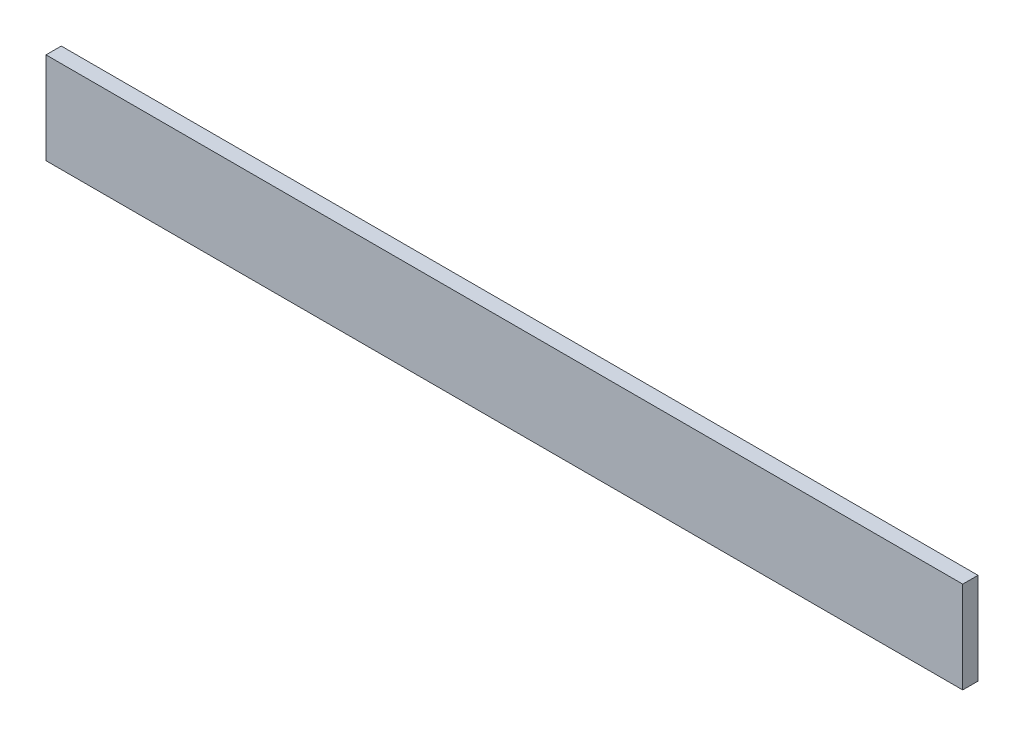
ISO-10303-21;
HEADER;
FILE_DESCRIPTION(('STEP AP214'),'2;1');
FILE_NAME('part.step','',(''),(''),'','','');
FILE_SCHEMA(('AUTOMOTIVE_DESIGN { 1 0 10303 214 1 1 1 1 }'));
ENDSEC;
DATA;
#1=APPLICATION_CONTEXT('core data for automotive mechanical design processes');
#2=APPLICATION_PROTOCOL_DEFINITION('international standard','automotive_design',2000,#1);
#3=PRODUCT_CONTEXT('',#1,'mechanical');
#4=PRODUCT('Part','Part','',(#3));
#5=PRODUCT_RELATED_PRODUCT_CATEGORY('part','',(#4));
#6=PRODUCT_DEFINITION_FORMATION('','',#4);
#7=PRODUCT_DEFINITION_CONTEXT('part definition',#1,'design');
#8=PRODUCT_DEFINITION('design','',#6,#7);
#9=PRODUCT_DEFINITION_SHAPE('','',#8);
#10=(LENGTH_UNIT() NAMED_UNIT(*) SI_UNIT(.MILLI.,.METRE.));
#11=(NAMED_UNIT(*) PLANE_ANGLE_UNIT() SI_UNIT($,.RADIAN.));
#12=(NAMED_UNIT(*) SI_UNIT($,.STERADIAN.) SOLID_ANGLE_UNIT());
#13=UNCERTAINTY_MEASURE_WITH_UNIT(LENGTH_MEASURE(1.E-05),#10,'distance_accuracy_value','');
#14=(GEOMETRIC_REPRESENTATION_CONTEXT(3) GLOBAL_UNCERTAINTY_ASSIGNED_CONTEXT((#13)) GLOBAL_UNIT_ASSIGNED_CONTEXT((#10,
#11,#12)) REPRESENTATION_CONTEXT('',''));
#15=CARTESIAN_POINT('',(0.,0.,0.));
#16=DIRECTION('',(0.,0.,1.));
#17=DIRECTION('',(1.,0.,0.));
#18=AXIS2_PLACEMENT_3D('',#15,#16,#17);
#19=CARTESIAN_POINT('',(0.,0.,5.));
#20=DIRECTION('',(1.,0.,0.));
#21=DIRECTION('',(0.,0.,-1.));
#22=AXIS2_PLACEMENT_3D('',#19,#20,#21);
#23=PLANE('',#22);
#24=DIRECTION('',(0.,-1.,0.));
#25=VECTOR('',#24,1.);
#26=CARTESIAN_POINT('',(0.,0.,0.));
#27=LINE('',#26,#25);
#28=CARTESIAN_POINT('',(0.,30.,0.));
#29=VERTEX_POINT('',#28);
#30=CARTESIAN_POINT('',(0.,0.,0.));
#31=VERTEX_POINT('',#30);
#32=EDGE_CURVE('E96',#29,#31,#27,.T.);
#33=ORIENTED_EDGE('',*,*,#32,.T.);
#34=DIRECTION('',(0.,0.,-1.));
#35=VECTOR('',#34,1.);
#36=CARTESIAN_POINT('',(0.,0.,5.));
#37=LINE('',#36,#35);
#38=CARTESIAN_POINT('',(0.,0.,5.));
#39=VERTEX_POINT('',#38);
#40=EDGE_CURVE('E11',#39,#31,#37,.T.);
#41=ORIENTED_EDGE('',*,*,#40,.F.);
#42=DIRECTION('',(0.,-1.,0.));
#43=VECTOR('',#42,1.);
#44=CARTESIAN_POINT('',(0.,0.,5.));
#45=LINE('',#44,#43);
#46=CARTESIAN_POINT('',(0.,30.,5.));
#47=VERTEX_POINT('',#46);
#48=EDGE_CURVE('E84',#47,#39,#45,.T.);
#49=ORIENTED_EDGE('',*,*,#48,.F.);
#50=DIRECTION('',(0.,0.,-1.));
#51=VECTOR('',#50,1.);
#52=CARTESIAN_POINT('',(0.,30.,5.));
#53=LINE('',#52,#51);
#54=EDGE_CURVE('E92',#47,#29,#53,.T.);
#55=ORIENTED_EDGE('',*,*,#54,.T.);
#56=EDGE_LOOP('',(#33,#41,#49,#55));
#57=FACE_BOUND('',#56,.T.);
#58=ADVANCED_FACE('F33',(#57),#23,.F.);
#59=CARTESIAN_POINT('',(0.,0.,5.));
#60=DIRECTION('',(0.,1.,0.));
#61=DIRECTION('',(0.,0.,1.));
#62=AXIS2_PLACEMENT_3D('',#59,#60,#61);
#63=PLANE('',#62);
#64=DIRECTION('',(1.,0.,0.));
#65=VECTOR('',#64,1.);
#66=CARTESIAN_POINT('',(0.,0.,0.));
#67=LINE('',#66,#65);
#68=CARTESIAN_POINT('',(300.,0.,0.));
#69=VERTEX_POINT('',#68);
#70=EDGE_CURVE('E88',#31,#69,#67,.T.);
#71=ORIENTED_EDGE('',*,*,#70,.T.);
#72=DIRECTION('',(0.,0.,-1.));
#73=VECTOR('',#72,1.);
#74=CARTESIAN_POINT('',(300.,0.,5.));
#75=LINE('',#74,#73);
#76=CARTESIAN_POINT('',(300.,0.,5.));
#77=VERTEX_POINT('',#76);
#78=EDGE_CURVE('E41',#77,#69,#75,.T.);
#79=ORIENTED_EDGE('',*,*,#78,.F.);
#80=DIRECTION('',(1.,0.,0.));
#81=VECTOR('',#80,1.);
#82=CARTESIAN_POINT('',(0.,0.,5.));
#83=LINE('',#82,#81);
#84=EDGE_CURVE('E79',#39,#77,#83,.T.);
#85=ORIENTED_EDGE('',*,*,#84,.F.);
#86=ORIENTED_EDGE('',*,*,#40,.T.);
#87=EDGE_LOOP('',(#71,#79,#85,#86));
#88=FACE_BOUND('',#87,.T.);
#89=ADVANCED_FACE('F87',(#88),#63,.F.);
#90=CARTESIAN_POINT('',(300.,0.,5.));
#91=DIRECTION('',(-1.,0.,0.));
#92=DIRECTION('',(0.,0.,1.));
#93=AXIS2_PLACEMENT_3D('',#90,#91,#92);
#94=PLANE('',#93);
#95=DIRECTION('',(0.,1.,0.));
#96=VECTOR('',#95,1.);
#97=CARTESIAN_POINT('',(300.,0.,0.));
#98=LINE('',#97,#96);
#99=CARTESIAN_POINT('',(300.,30.,0.));
#100=VERTEX_POINT('',#99);
#101=EDGE_CURVE('E66',#69,#100,#98,.T.);
#102=ORIENTED_EDGE('',*,*,#101,.T.);
#103=DIRECTION('',(0.,0.,-1.));
#104=VECTOR('',#103,1.);
#105=CARTESIAN_POINT('',(300.,30.,5.));
#106=LINE('',#105,#104);
#107=CARTESIAN_POINT('',(300.,30.,5.));
#108=VERTEX_POINT('',#107);
#109=EDGE_CURVE('E89',#108,#100,#106,.T.);
#110=ORIENTED_EDGE('',*,*,#109,.F.);
#111=DIRECTION('',(0.,1.,0.));
#112=VECTOR('',#111,1.);
#113=CARTESIAN_POINT('',(300.,0.,5.));
#114=LINE('',#113,#112);
#115=EDGE_CURVE('E82',#77,#108,#114,.T.);
#116=ORIENTED_EDGE('',*,*,#115,.F.);
#117=ORIENTED_EDGE('',*,*,#78,.T.);
#118=EDGE_LOOP('',(#102,#110,#116,#117));
#119=FACE_BOUND('',#118,.T.);
#120=ADVANCED_FACE('F90',(#119),#94,.F.);
#121=CARTESIAN_POINT('',(0.,30.,5.));
#122=DIRECTION('',(0.,-1.,0.));
#123=DIRECTION('',(0.,0.,-1.));
#124=AXIS2_PLACEMENT_3D('',#121,#122,#123);
#125=PLANE('',#124);
#126=DIRECTION('',(-1.,0.,0.));
#127=VECTOR('',#126,1.);
#128=CARTESIAN_POINT('',(0.,30.,0.));
#129=LINE('',#128,#127);
#130=EDGE_CURVE('E72',#100,#29,#129,.T.);
#131=ORIENTED_EDGE('',*,*,#130,.T.);
#132=ORIENTED_EDGE('',*,*,#54,.F.);
#133=DIRECTION('',(-1.,0.,0.));
#134=VECTOR('',#133,1.);
#135=CARTESIAN_POINT('',(0.,30.,5.));
#136=LINE('',#135,#134);
#137=EDGE_CURVE('E49',#108,#47,#136,.T.);
#138=ORIENTED_EDGE('',*,*,#137,.F.);
#139=ORIENTED_EDGE('',*,*,#109,.T.);
#140=EDGE_LOOP('',(#131,#132,#138,#139));
#141=FACE_BOUND('',#140,.T.);
#142=ADVANCED_FACE('F103',(#141),#125,.F.);
#143=CARTESIAN_POINT('',(0.,0.,5.));
#144=DIRECTION('',(0.,0.,-1.));
#145=DIRECTION('',(-1.,0.,0.));
#146=AXIS2_PLACEMENT_3D('',#143,#144,#145);
#147=PLANE('',#146);
#148=ORIENTED_EDGE('',*,*,#48,.T.);
#149=ORIENTED_EDGE('',*,*,#84,.T.);
#150=ORIENTED_EDGE('',*,*,#115,.T.);
#151=ORIENTED_EDGE('',*,*,#137,.T.);
#152=EDGE_LOOP('',(#148,#149,#150,#151));
#153=FACE_BOUND('',#152,.T.);
#154=ADVANCED_FACE('F80',(#153),#147,.F.);
#155=CARTESIAN_POINT('',(0.,0.,0.));
#156=DIRECTION('',(0.,0.,-1.));
#157=DIRECTION('',(-1.,0.,0.));
#158=AXIS2_PLACEMENT_3D('',#155,#156,#157);
#159=PLANE('',#158);
#160=ORIENTED_EDGE('',*,*,#32,.F.);
#161=ORIENTED_EDGE('',*,*,#130,.F.);
#162=ORIENTED_EDGE('',*,*,#101,.F.);
#163=ORIENTED_EDGE('',*,*,#70,.F.);
#164=EDGE_LOOP('',(#160,#161,#162,#163));
#165=FACE_BOUND('',#164,.T.);
#166=ADVANCED_FACE('F106',(#165),#159,.T.);
#167=CLOSED_SHELL('',(#58,#89,#120,#142,#154,#166));
#168=MANIFOLD_SOLID_BREP('B2',#167);
#169=ADVANCED_BREP_SHAPE_REPRESENTATION('',(#18,#168),#14);
#170=SHAPE_DEFINITION_REPRESENTATION(#9,#169);
ENDSEC;
END-ISO-10303-21;
